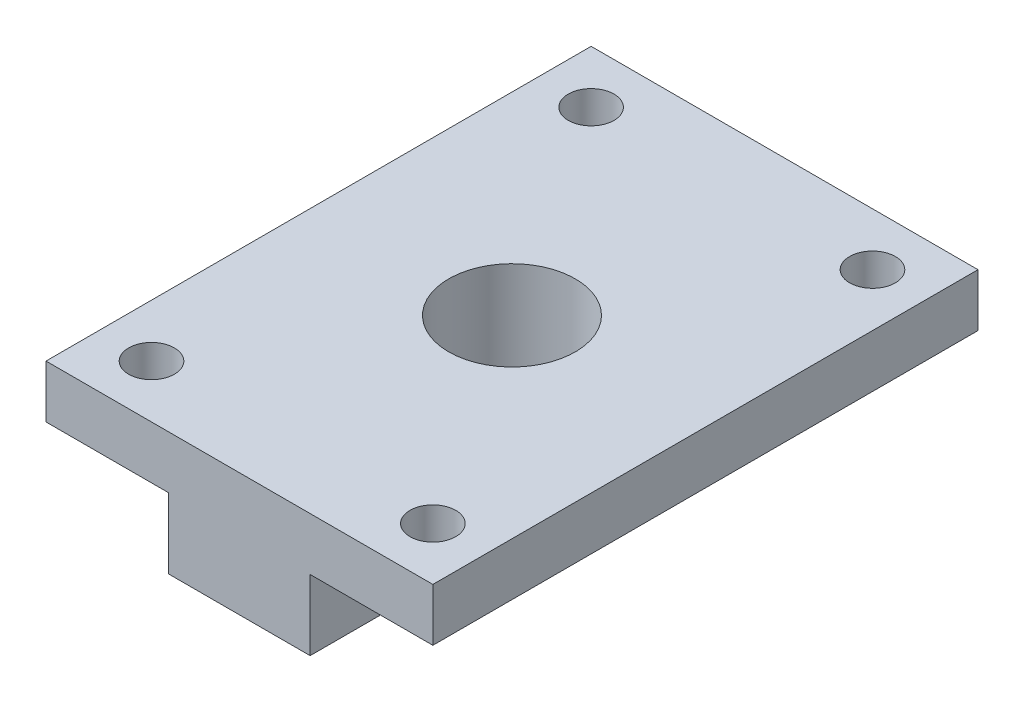
ISO-10303-21;
HEADER;
FILE_DESCRIPTION(('STEP AP214'),'2;1');
FILE_NAME('part.step','',(''),(''),'','','');
FILE_SCHEMA(('AUTOMOTIVE_DESIGN { 1 0 10303 214 1 1 1 1 }'));
ENDSEC;
DATA;
#1=APPLICATION_CONTEXT('core data for automotive mechanical design processes');
#2=APPLICATION_PROTOCOL_DEFINITION('international standard','automotive_design',2000,#1);
#3=PRODUCT_CONTEXT('',#1,'mechanical');
#4=PRODUCT('Part','Part','',(#3));
#5=PRODUCT_RELATED_PRODUCT_CATEGORY('part','',(#4));
#6=PRODUCT_DEFINITION_FORMATION('','',#4);
#7=PRODUCT_DEFINITION_CONTEXT('part definition',#1,'design');
#8=PRODUCT_DEFINITION('design','',#6,#7);
#9=PRODUCT_DEFINITION_SHAPE('','',#8);
#10=(LENGTH_UNIT() NAMED_UNIT(*) SI_UNIT(.MILLI.,.METRE.));
#11=(NAMED_UNIT(*) PLANE_ANGLE_UNIT() SI_UNIT($,.RADIAN.));
#12=(NAMED_UNIT(*) SI_UNIT($,.STERADIAN.) SOLID_ANGLE_UNIT());
#13=UNCERTAINTY_MEASURE_WITH_UNIT(LENGTH_MEASURE(1.E-05),#10,'distance_accuracy_value','');
#14=(GEOMETRIC_REPRESENTATION_CONTEXT(3) GLOBAL_UNCERTAINTY_ASSIGNED_CONTEXT((#13)) GLOBAL_UNIT_ASSIGNED_CONTEXT((#10,
#11,#12)) REPRESENTATION_CONTEXT('',''));
#15=CARTESIAN_POINT('',(0.,0.,0.));
#16=DIRECTION('',(0.,0.,1.));
#17=DIRECTION('',(1.,0.,0.));
#18=AXIS2_PLACEMENT_3D('',#15,#16,#17);
#19=CARTESIAN_POINT('',(-11.,7.,-15.5));
#20=DIRECTION('',(1.,0.,0.));
#21=DIRECTION('',(0.,0.,-1.));
#22=AXIS2_PLACEMENT_3D('',#19,#20,#21);
#23=PLANE('',#22);
#24=DIRECTION('',(0.,0.,-1.));
#25=VECTOR('',#24,1.);
#26=CARTESIAN_POINT('',(-11.,4.,-15.5));
#27=LINE('',#26,#25);
#28=CARTESIAN_POINT('',(-11.,4.,15.5));
#29=VERTEX_POINT('',#28);
#30=CARTESIAN_POINT('',(-11.,4.,-15.5));
#31=VERTEX_POINT('',#30);
#32=EDGE_CURVE('E57',#29,#31,#27,.T.);
#33=ORIENTED_EDGE('',*,*,#32,.F.);
#34=DIRECTION('',(0.,-1.,0.));
#35=VECTOR('',#34,1.);
#36=CARTESIAN_POINT('',(-11.,7.,15.5));
#37=LINE('',#36,#35);
#38=CARTESIAN_POINT('',(-11.,7.,15.5));
#39=VERTEX_POINT('',#38);
#40=EDGE_CURVE('E11',#39,#29,#37,.T.);
#41=ORIENTED_EDGE('',*,*,#40,.F.);
#42=DIRECTION('',(0.,0.,1.));
#43=VECTOR('',#42,1.);
#44=CARTESIAN_POINT('',(-11.,7.,-15.5));
#45=LINE('',#44,#43);
#46=CARTESIAN_POINT('',(-11.,7.,-15.5));
#47=VERTEX_POINT('',#46);
#48=EDGE_CURVE('E180',#47,#39,#45,.T.);
#49=ORIENTED_EDGE('',*,*,#48,.F.);
#50=DIRECTION('',(0.,-1.,0.));
#51=VECTOR('',#50,1.);
#52=CARTESIAN_POINT('',(-11.,7.,-15.5));
#53=LINE('',#52,#51);
#54=EDGE_CURVE('E121',#47,#31,#53,.T.);
#55=ORIENTED_EDGE('',*,*,#54,.T.);
#56=EDGE_LOOP('',(#33,#41,#49,#55));
#57=FACE_BOUND('',#56,.T.);
#58=ADVANCED_FACE('F33',(#57),#23,.F.);
#59=CARTESIAN_POINT('',(-8.,7.,-12.5));
#60=DIRECTION('',(0.,-1.,0.));
#61=DIRECTION('',(0.,0.,-1.));
#62=AXIS2_PLACEMENT_3D('',#59,#60,#61);
#63=CYLINDRICAL_SURFACE('',#62,1.3);
#64=CARTESIAN_POINT('',(-8.,7.,-12.5));
#65=DIRECTION('',(0.,1.,0.));
#66=DIRECTION('',(0.,0.,1.));
#67=AXIS2_PLACEMENT_3D('',#64,#65,#66);
#68=CIRCLE('',#67,1.3);
#69=CARTESIAN_POINT('',(-8.,7.,-11.2));
#70=VERTEX_POINT('',#69);
#71=EDGE_CURVE('E176',#70,#70,#68,.T.);
#72=ORIENTED_EDGE('',*,*,#71,.T.);
#73=EDGE_LOOP('',(#72));
#74=FACE_BOUND('',#73,.T.);
#75=CARTESIAN_POINT('',(-8.,4.,-12.5));
#76=DIRECTION('',(0.,-1.,0.));
#77=DIRECTION('',(0.,0.,-1.));
#78=AXIS2_PLACEMENT_3D('',#75,#76,#77);
#79=CIRCLE('',#78,1.3);
#80=CARTESIAN_POINT('',(-8.,4.,-13.8));
#81=VERTEX_POINT('',#80);
#82=EDGE_CURVE('E163',#81,#81,#79,.T.);
#83=ORIENTED_EDGE('',*,*,#82,.T.);
#84=EDGE_LOOP('',(#83));
#85=FACE_BOUND('',#84,.T.);
#86=ADVANCED_FACE('F226',(#74,#85),#63,.F.);
#87=CARTESIAN_POINT('',(-8.,7.,12.5));
#88=DIRECTION('',(0.,-1.,0.));
#89=DIRECTION('',(0.,0.,-1.));
#90=AXIS2_PLACEMENT_3D('',#87,#88,#89);
#91=CYLINDRICAL_SURFACE('',#90,1.3);
#92=CARTESIAN_POINT('',(-8.,7.,12.5));
#93=DIRECTION('',(0.,1.,0.));
#94=DIRECTION('',(0.,0.,1.));
#95=AXIS2_PLACEMENT_3D('',#92,#93,#94);
#96=CIRCLE('',#95,1.3);
#97=CARTESIAN_POINT('',(-8.,7.,13.8));
#98=VERTEX_POINT('',#97);
#99=EDGE_CURVE('E170',#98,#98,#96,.T.);
#100=ORIENTED_EDGE('',*,*,#99,.T.);
#101=EDGE_LOOP('',(#100));
#102=FACE_BOUND('',#101,.T.);
#103=CARTESIAN_POINT('',(-8.,4.,12.5));
#104=DIRECTION('',(0.,-1.,0.));
#105=DIRECTION('',(0.,0.,-1.));
#106=AXIS2_PLACEMENT_3D('',#103,#104,#105);
#107=CIRCLE('',#106,1.3);
#108=CARTESIAN_POINT('',(-8.,4.,11.2));
#109=VERTEX_POINT('',#108);
#110=EDGE_CURVE('E36',#109,#109,#107,.T.);
#111=ORIENTED_EDGE('',*,*,#110,.T.);
#112=EDGE_LOOP('',(#111));
#113=FACE_BOUND('',#112,.T.);
#114=ADVANCED_FACE('F230',(#102,#113),#91,.F.);
#115=CARTESIAN_POINT('',(0.,7.,0.));
#116=DIRECTION('',(0.,1.,0.));
#117=DIRECTION('',(0.,0.,1.));
#118=AXIS2_PLACEMENT_3D('',#115,#116,#117);
#119=PLANE('',#118);
#120=CARTESIAN_POINT('',(0.,7.,0.));
#121=DIRECTION('',(0.,1.,0.));
#122=DIRECTION('',(0.,0.,1.));
#123=AXIS2_PLACEMENT_3D('',#120,#121,#122);
#124=CIRCLE('',#123,3.6);
#125=CARTESIAN_POINT('',(0.,7.,3.6));
#126=VERTEX_POINT('',#125);
#127=EDGE_CURVE('E131',#126,#126,#124,.T.);
#128=ORIENTED_EDGE('',*,*,#127,.F.);
#129=EDGE_LOOP('',(#128));
#130=FACE_BOUND('',#129,.T.);
#131=ORIENTED_EDGE('',*,*,#99,.F.);
#132=EDGE_LOOP('',(#131));
#133=FACE_BOUND('',#132,.T.);
#134=ORIENTED_EDGE('',*,*,#71,.F.);
#135=EDGE_LOOP('',(#134));
#136=FACE_BOUND('',#135,.T.);
#137=ORIENTED_EDGE('',*,*,#48,.T.);
#138=DIRECTION('',(1.,0.,0.));
#139=VECTOR('',#138,1.);
#140=CARTESIAN_POINT('',(-11.,7.,15.5));
#141=LINE('',#140,#139);
#142=CARTESIAN_POINT('',(11.,7.,15.5));
#143=VERTEX_POINT('',#142);
#144=EDGE_CURVE('E183',#39,#143,#141,.T.);
#145=ORIENTED_EDGE('',*,*,#144,.T.);
#146=DIRECTION('',(0.,0.,-1.));
#147=VECTOR('',#146,1.);
#148=CARTESIAN_POINT('',(11.,7.,-15.5));
#149=LINE('',#148,#147);
#150=CARTESIAN_POINT('',(11.,7.,-15.5));
#151=VERTEX_POINT('',#150);
#152=EDGE_CURVE('E186',#143,#151,#149,.T.);
#153=ORIENTED_EDGE('',*,*,#152,.T.);
#154=DIRECTION('',(-1.,0.,0.));
#155=VECTOR('',#154,1.);
#156=CARTESIAN_POINT('',(-11.,7.,-15.5));
#157=LINE('',#156,#155);
#158=EDGE_CURVE('E120',#151,#47,#157,.T.);
#159=ORIENTED_EDGE('',*,*,#158,.T.);
#160=EDGE_LOOP('',(#137,#145,#153,#159));
#161=FACE_BOUND('',#160,.T.);
#162=CARTESIAN_POINT('',(8.,7.,-12.5));
#163=DIRECTION('',(0.,1.,0.));
#164=DIRECTION('',(0.,0.,1.));
#165=AXIS2_PLACEMENT_3D('',#162,#163,#164);
#166=CIRCLE('',#165,1.3);
#167=CARTESIAN_POINT('',(8.,7.,-11.2));
#168=VERTEX_POINT('',#167);
#169=EDGE_CURVE('E173',#168,#168,#166,.T.);
#170=ORIENTED_EDGE('',*,*,#169,.F.);
#171=EDGE_LOOP('',(#170));
#172=FACE_BOUND('',#171,.T.);
#173=CARTESIAN_POINT('',(8.,7.,12.5));
#174=DIRECTION('',(0.,1.,0.));
#175=DIRECTION('',(0.,0.,1.));
#176=AXIS2_PLACEMENT_3D('',#173,#174,#175);
#177=CIRCLE('',#176,1.3);
#178=CARTESIAN_POINT('',(8.,7.,13.8));
#179=VERTEX_POINT('',#178);
#180=EDGE_CURVE('E130',#179,#179,#177,.T.);
#181=ORIENTED_EDGE('',*,*,#180,.F.);
#182=EDGE_LOOP('',(#181));
#183=FACE_BOUND('',#182,.T.);
#184=ADVANCED_FACE('F207',(#130,#133,#136,#161,#172,#183),#119,.T.);
#185=CARTESIAN_POINT('',(0.,0.,0.));
#186=DIRECTION('',(0.,1.,0.));
#187=DIRECTION('',(0.,0.,1.));
#188=AXIS2_PLACEMENT_3D('',#185,#186,#187);
#189=PLANE('',#188);
#190=CARTESIAN_POINT('',(0.,0.,0.));
#191=DIRECTION('',(0.,1.,0.));
#192=DIRECTION('',(0.,0.,1.));
#193=AXIS2_PLACEMENT_3D('',#190,#191,#192);
#194=CIRCLE('',#193,3.6);
#195=CARTESIAN_POINT('',(0.,0.,3.6));
#196=VERTEX_POINT('',#195);
#197=EDGE_CURVE('E128',#196,#196,#194,.T.);
#198=ORIENTED_EDGE('',*,*,#197,.T.);
#199=EDGE_LOOP('',(#198));
#200=FACE_BOUND('',#199,.T.);
#201=DIRECTION('',(-1.,0.,0.));
#202=VECTOR('',#201,1.);
#203=CARTESIAN_POINT('',(-11.,0.,-15.5));
#204=LINE('',#203,#202);
#205=CARTESIAN_POINT('',(4.02,0.,-15.5));
#206=VERTEX_POINT('',#205);
#207=CARTESIAN_POINT('',(-4.02,0.,-15.5));
#208=VERTEX_POINT('',#207);
#209=EDGE_CURVE('E184',#206,#208,#204,.T.);
#210=ORIENTED_EDGE('',*,*,#209,.F.);
#211=DIRECTION('',(0.,0.,-1.));
#212=VECTOR('',#211,1.);
#213=CARTESIAN_POINT('',(4.02,0.,-15.5));
#214=LINE('',#213,#212);
#215=CARTESIAN_POINT('',(4.02,0.,15.5));
#216=VERTEX_POINT('',#215);
#217=EDGE_CURVE('E106',#216,#206,#214,.T.);
#218=ORIENTED_EDGE('',*,*,#217,.F.);
#219=DIRECTION('',(1.,0.,0.));
#220=VECTOR('',#219,1.);
#221=CARTESIAN_POINT('',(-11.,0.,15.5));
#222=LINE('',#221,#220);
#223=CARTESIAN_POINT('',(-4.02,0.,15.5));
#224=VERTEX_POINT('',#223);
#225=EDGE_CURVE('E179',#224,#216,#222,.T.);
#226=ORIENTED_EDGE('',*,*,#225,.F.);
#227=DIRECTION('',(0.,0.,1.));
#228=VECTOR('',#227,1.);
#229=CARTESIAN_POINT('',(-4.02,0.,-15.5));
#230=LINE('',#229,#228);
#231=EDGE_CURVE('E151',#208,#224,#230,.T.);
#232=ORIENTED_EDGE('',*,*,#231,.F.);
#233=EDGE_LOOP('',(#210,#218,#226,#232));
#234=FACE_BOUND('',#233,.T.);
#235=ADVANCED_FACE('F194',(#200,#234),#189,.F.);
#236=CARTESIAN_POINT('',(-11.,7.,15.5));
#237=DIRECTION('',(0.,0.,-1.));
#238=DIRECTION('',(-1.,0.,0.));
#239=AXIS2_PLACEMENT_3D('',#236,#237,#238);
#240=PLANE('',#239);
#241=ORIENTED_EDGE('',*,*,#225,.T.);
#242=DIRECTION('',(0.,-1.,0.));
#243=VECTOR('',#242,1.);
#244=CARTESIAN_POINT('',(4.02,4.,15.5));
#245=LINE('',#244,#243);
#246=CARTESIAN_POINT('',(4.02,4.,15.5));
#247=VERTEX_POINT('',#246);
#248=EDGE_CURVE('E140',#247,#216,#245,.T.);
#249=ORIENTED_EDGE('',*,*,#248,.F.);
#250=DIRECTION('',(-1.,0.,0.));
#251=VECTOR('',#250,1.);
#252=CARTESIAN_POINT('',(11.,4.,15.5));
#253=LINE('',#252,#251);
#254=CARTESIAN_POINT('',(11.,4.,15.5));
#255=VERTEX_POINT('',#254);
#256=EDGE_CURVE('E116',#255,#247,#253,.T.);
#257=ORIENTED_EDGE('',*,*,#256,.F.);
#258=DIRECTION('',(0.,-1.,0.));
#259=VECTOR('',#258,1.);
#260=CARTESIAN_POINT('',(11.,7.,15.5));
#261=LINE('',#260,#259);
#262=EDGE_CURVE('E41',#143,#255,#261,.T.);
#263=ORIENTED_EDGE('',*,*,#262,.F.);
#264=ORIENTED_EDGE('',*,*,#144,.F.);
#265=ORIENTED_EDGE('',*,*,#40,.T.);
#266=DIRECTION('',(-1.,0.,0.));
#267=VECTOR('',#266,1.);
#268=CARTESIAN_POINT('',(-11.,4.,15.5));
#269=LINE('',#268,#267);
#270=CARTESIAN_POINT('',(-4.02,4.,15.5));
#271=VERTEX_POINT('',#270);
#272=EDGE_CURVE('E154',#271,#29,#269,.T.);
#273=ORIENTED_EDGE('',*,*,#272,.F.);
#274=DIRECTION('',(0.,-1.,0.));
#275=VECTOR('',#274,1.);
#276=CARTESIAN_POINT('',(-4.02,4.,15.5));
#277=LINE('',#276,#275);
#278=EDGE_CURVE('E159',#271,#224,#277,.T.);
#279=ORIENTED_EDGE('',*,*,#278,.T.);
#280=EDGE_LOOP('',(#241,#249,#257,#263,#264,#265,#273,#279));
#281=FACE_BOUND('',#280,.T.);
#282=ADVANCED_FACE('F200',(#281),#240,.F.);
#283=CARTESIAN_POINT('',(11.,7.,-15.5));
#284=DIRECTION('',(-1.,0.,0.));
#285=DIRECTION('',(0.,0.,1.));
#286=AXIS2_PLACEMENT_3D('',#283,#284,#285);
#287=PLANE('',#286);
#288=ORIENTED_EDGE('',*,*,#262,.T.);
#289=DIRECTION('',(0.,0.,1.));
#290=VECTOR('',#289,1.);
#291=CARTESIAN_POINT('',(11.,4.,-15.5));
#292=LINE('',#291,#290);
#293=CARTESIAN_POINT('',(11.,4.,-15.5));
#294=VERTEX_POINT('',#293);
#295=EDGE_CURVE('E101',#294,#255,#292,.T.);
#296=ORIENTED_EDGE('',*,*,#295,.F.);
#297=DIRECTION('',(0.,-1.,0.));
#298=VECTOR('',#297,1.);
#299=CARTESIAN_POINT('',(11.,7.,-15.5));
#300=LINE('',#299,#298);
#301=EDGE_CURVE('E113',#151,#294,#300,.T.);
#302=ORIENTED_EDGE('',*,*,#301,.F.);
#303=ORIENTED_EDGE('',*,*,#152,.F.);
#304=EDGE_LOOP('',(#288,#296,#302,#303));
#305=FACE_BOUND('',#304,.T.);
#306=ADVANCED_FACE('F111',(#305),#287,.F.);
#307=CARTESIAN_POINT('',(-11.,7.,-15.5));
#308=DIRECTION('',(0.,0.,1.));
#309=DIRECTION('',(1.,0.,0.));
#310=AXIS2_PLACEMENT_3D('',#307,#308,#309);
#311=PLANE('',#310);
#312=DIRECTION('',(1.,0.,0.));
#313=VECTOR('',#312,1.);
#314=CARTESIAN_POINT('',(11.,4.,-15.5));
#315=LINE('',#314,#313);
#316=CARTESIAN_POINT('',(4.02,4.,-15.5));
#317=VERTEX_POINT('',#316);
#318=EDGE_CURVE('E98',#317,#294,#315,.T.);
#319=ORIENTED_EDGE('',*,*,#318,.F.);
#320=DIRECTION('',(0.,-1.,0.));
#321=VECTOR('',#320,1.);
#322=CARTESIAN_POINT('',(4.02,4.,-15.5));
#323=LINE('',#322,#321);
#324=EDGE_CURVE('E135',#317,#206,#323,.T.);
#325=ORIENTED_EDGE('',*,*,#324,.T.);
#326=ORIENTED_EDGE('',*,*,#209,.T.);
#327=DIRECTION('',(0.,-1.,0.));
#328=VECTOR('',#327,1.);
#329=CARTESIAN_POINT('',(-4.02,4.,-15.5));
#330=LINE('',#329,#328);
#331=CARTESIAN_POINT('',(-4.02,4.,-15.5));
#332=VERTEX_POINT('',#331);
#333=EDGE_CURVE('E157',#332,#208,#330,.T.);
#334=ORIENTED_EDGE('',*,*,#333,.F.);
#335=DIRECTION('',(1.,0.,0.));
#336=VECTOR('',#335,1.);
#337=CARTESIAN_POINT('',(-11.,4.,-15.5));
#338=LINE('',#337,#336);
#339=EDGE_CURVE('E148',#31,#332,#338,.T.);
#340=ORIENTED_EDGE('',*,*,#339,.F.);
#341=ORIENTED_EDGE('',*,*,#54,.F.);
#342=ORIENTED_EDGE('',*,*,#158,.F.);
#343=ORIENTED_EDGE('',*,*,#301,.T.);
#344=EDGE_LOOP('',(#319,#325,#326,#334,#340,#341,#342,#343));
#345=FACE_BOUND('',#344,.T.);
#346=ADVANCED_FACE('F118',(#345),#311,.F.);
#347=CARTESIAN_POINT('',(8.,7.,-12.5));
#348=DIRECTION('',(0.,-1.,0.));
#349=DIRECTION('',(0.,0.,-1.));
#350=AXIS2_PLACEMENT_3D('',#347,#348,#349);
#351=CYLINDRICAL_SURFACE('',#350,1.3);
#352=CARTESIAN_POINT('',(8.,4.,-12.5));
#353=DIRECTION('',(0.,1.,0.));
#354=DIRECTION('',(0.,0.,1.));
#355=AXIS2_PLACEMENT_3D('',#352,#353,#354);
#356=CIRCLE('',#355,1.3);
#357=CARTESIAN_POINT('',(8.,4.,-11.2));
#358=VERTEX_POINT('',#357);
#359=EDGE_CURVE('E134',#358,#358,#356,.T.);
#360=ORIENTED_EDGE('',*,*,#359,.F.);
#361=EDGE_LOOP('',(#360));
#362=FACE_BOUND('',#361,.T.);
#363=ORIENTED_EDGE('',*,*,#169,.T.);
#364=EDGE_LOOP('',(#363));
#365=FACE_BOUND('',#364,.T.);
#366=ADVANCED_FACE('F241',(#362,#365),#351,.F.);
#367=CARTESIAN_POINT('',(8.,7.,12.5));
#368=DIRECTION('',(0.,-1.,0.));
#369=DIRECTION('',(0.,0.,-1.));
#370=AXIS2_PLACEMENT_3D('',#367,#368,#369);
#371=CYLINDRICAL_SURFACE('',#370,1.3);
#372=CARTESIAN_POINT('',(8.,4.,12.5));
#373=DIRECTION('',(0.,1.,0.));
#374=DIRECTION('',(0.,0.,1.));
#375=AXIS2_PLACEMENT_3D('',#372,#373,#374);
#376=CIRCLE('',#375,1.3);
#377=CARTESIAN_POINT('',(8.,4.,13.8));
#378=VERTEX_POINT('',#377);
#379=EDGE_CURVE('E132',#378,#378,#376,.T.);
#380=ORIENTED_EDGE('',*,*,#379,.F.);
#381=EDGE_LOOP('',(#380));
#382=FACE_BOUND('',#381,.T.);
#383=ORIENTED_EDGE('',*,*,#180,.T.);
#384=EDGE_LOOP('',(#383));
#385=FACE_BOUND('',#384,.T.);
#386=ADVANCED_FACE('F221',(#382,#385),#371,.F.);
#387=CARTESIAN_POINT('',(0.,-3.,0.));
#388=DIRECTION('',(0.,1.,0.));
#389=DIRECTION('',(0.,0.,1.));
#390=AXIS2_PLACEMENT_3D('',#387,#388,#389);
#391=CYLINDRICAL_SURFACE('',#390,3.6);
#392=ORIENTED_EDGE('',*,*,#127,.T.);
#393=EDGE_LOOP('',(#392));
#394=FACE_BOUND('',#393,.T.);
#395=ORIENTED_EDGE('',*,*,#197,.F.);
#396=EDGE_LOOP('',(#395));
#397=FACE_BOUND('',#396,.T.);
#398=ADVANCED_FACE('F213',(#394,#397),#391,.F.);
#399=CARTESIAN_POINT('',(4.02,4.,-15.5));
#400=DIRECTION('',(-1.,0.,0.));
#401=DIRECTION('',(0.,0.,1.));
#402=AXIS2_PLACEMENT_3D('',#399,#400,#401);
#403=PLANE('',#402);
#404=ORIENTED_EDGE('',*,*,#217,.T.);
#405=ORIENTED_EDGE('',*,*,#324,.F.);
#406=DIRECTION('',(0.,0.,-1.));
#407=VECTOR('',#406,1.);
#408=CARTESIAN_POINT('',(4.02,4.,-15.5));
#409=LINE('',#408,#407);
#410=EDGE_CURVE('E49',#247,#317,#409,.T.);
#411=ORIENTED_EDGE('',*,*,#410,.F.);
#412=ORIENTED_EDGE('',*,*,#248,.T.);
#413=EDGE_LOOP('',(#404,#405,#411,#412));
#414=FACE_BOUND('',#413,.T.);
#415=ADVANCED_FACE('F211',(#414),#403,.F.);
#416=CARTESIAN_POINT('',(0.,4.,0.));
#417=DIRECTION('',(0.,1.,0.));
#418=DIRECTION('',(0.,0.,1.));
#419=AXIS2_PLACEMENT_3D('',#416,#417,#418);
#420=PLANE('',#419);
#421=ORIENTED_EDGE('',*,*,#359,.T.);
#422=EDGE_LOOP('',(#421));
#423=FACE_BOUND('',#422,.T.);
#424=ORIENTED_EDGE('',*,*,#379,.T.);
#425=EDGE_LOOP('',(#424));
#426=FACE_BOUND('',#425,.T.);
#427=ORIENTED_EDGE('',*,*,#318,.T.);
#428=ORIENTED_EDGE('',*,*,#295,.T.);
#429=ORIENTED_EDGE('',*,*,#256,.T.);
#430=ORIENTED_EDGE('',*,*,#410,.T.);
#431=EDGE_LOOP('',(#427,#428,#429,#430));
#432=FACE_BOUND('',#431,.T.);
#433=ADVANCED_FACE('F100',(#423,#426,#432),#420,.F.);
#434=CARTESIAN_POINT('',(-4.02,4.,-15.5));
#435=DIRECTION('',(1.,0.,0.));
#436=DIRECTION('',(0.,0.,-1.));
#437=AXIS2_PLACEMENT_3D('',#434,#435,#436);
#438=PLANE('',#437);
#439=ORIENTED_EDGE('',*,*,#231,.T.);
#440=ORIENTED_EDGE('',*,*,#278,.F.);
#441=DIRECTION('',(0.,0.,1.));
#442=VECTOR('',#441,1.);
#443=CARTESIAN_POINT('',(-4.02,4.,-15.5));
#444=LINE('',#443,#442);
#445=EDGE_CURVE('E150',#332,#271,#444,.T.);
#446=ORIENTED_EDGE('',*,*,#445,.F.);
#447=ORIENTED_EDGE('',*,*,#333,.T.);
#448=EDGE_LOOP('',(#439,#440,#446,#447));
#449=FACE_BOUND('',#448,.T.);
#450=ADVANCED_FACE('F197',(#449),#438,.F.);
#451=CARTESIAN_POINT('',(0.,4.,0.));
#452=DIRECTION('',(0.,-1.,0.));
#453=DIRECTION('',(0.,0.,-1.));
#454=AXIS2_PLACEMENT_3D('',#451,#452,#453);
#455=PLANE('',#454);
#456=ORIENTED_EDGE('',*,*,#82,.F.);
#457=EDGE_LOOP('',(#456));
#458=FACE_BOUND('',#457,.T.);
#459=ORIENTED_EDGE('',*,*,#110,.F.);
#460=EDGE_LOOP('',(#459));
#461=FACE_BOUND('',#460,.T.);
#462=ORIENTED_EDGE('',*,*,#339,.T.);
#463=ORIENTED_EDGE('',*,*,#445,.T.);
#464=ORIENTED_EDGE('',*,*,#272,.T.);
#465=ORIENTED_EDGE('',*,*,#32,.T.);
#466=EDGE_LOOP('',(#462,#463,#464,#465));
#467=FACE_BOUND('',#466,.T.);
#468=ADVANCED_FACE('F203',(#458,#461,#467),#455,.T.);
#469=CLOSED_SHELL('',(#58,#86,#114,#184,#235,#282,#306,#346,#366,#386,#398,#415,#433,#450,#468));
#470=MANIFOLD_SOLID_BREP('B2',#469);
#471=ADVANCED_BREP_SHAPE_REPRESENTATION('',(#18,#470),#14);
#472=SHAPE_DEFINITION_REPRESENTATION(#9,#471);
ENDSEC;
END-ISO-10303-21;
